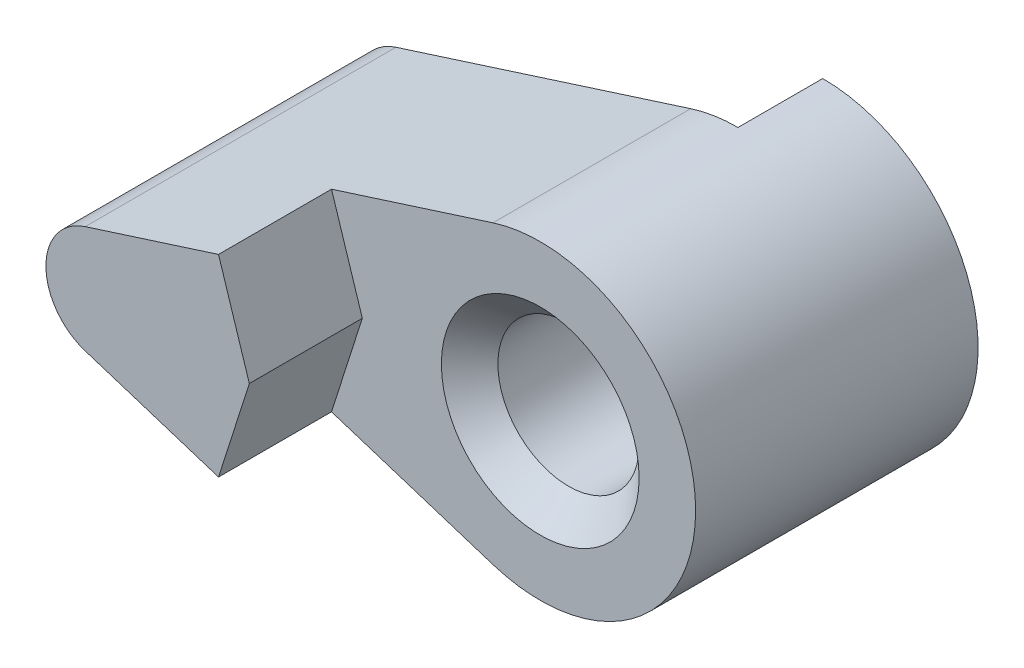
ISO-10303-21;
HEADER;
FILE_DESCRIPTION(('STEP AP214'),'2;1');
FILE_NAME('part.step','',(''),(''),'','','');
FILE_SCHEMA(('AUTOMOTIVE_DESIGN { 1 0 10303 214 1 1 1 1 }'));
ENDSEC;
DATA;
#1=APPLICATION_CONTEXT('core data for automotive mechanical design processes');
#2=APPLICATION_PROTOCOL_DEFINITION('international standard','automotive_design',2000,#1);
#3=PRODUCT_CONTEXT('',#1,'mechanical');
#4=PRODUCT('Part','Part','',(#3));
#5=PRODUCT_RELATED_PRODUCT_CATEGORY('part','',(#4));
#6=PRODUCT_DEFINITION_FORMATION('','',#4);
#7=PRODUCT_DEFINITION_CONTEXT('part definition',#1,'design');
#8=PRODUCT_DEFINITION('design','',#6,#7);
#9=PRODUCT_DEFINITION_SHAPE('','',#8);
#10=(LENGTH_UNIT() NAMED_UNIT(*) SI_UNIT(.MILLI.,.METRE.));
#11=(NAMED_UNIT(*) PLANE_ANGLE_UNIT() SI_UNIT($,.RADIAN.));
#12=(NAMED_UNIT(*) SI_UNIT($,.STERADIAN.) SOLID_ANGLE_UNIT());
#13=UNCERTAINTY_MEASURE_WITH_UNIT(LENGTH_MEASURE(1.E-05),#10,'distance_accuracy_value','');
#14=(GEOMETRIC_REPRESENTATION_CONTEXT(3) GLOBAL_UNCERTAINTY_ASSIGNED_CONTEXT((#13)) GLOBAL_UNIT_ASSIGNED_CONTEXT((#10,
#11,#12)) REPRESENTATION_CONTEXT('',''));
#15=CARTESIAN_POINT('',(0.,0.,0.));
#16=DIRECTION('',(0.,0.,1.));
#17=DIRECTION('',(1.,0.,0.));
#18=AXIS2_PLACEMENT_3D('',#15,#16,#17);
#19=CARTESIAN_POINT('',(-1.67391304347826,5.23908533265811,14.));
#20=DIRECTION('',(0.304347826086956,-0.952560969574202,0.));
#21=DIRECTION('',(0.952560969574202,0.304347826086957,0.));
#22=AXIS2_PLACEMENT_3D('',#19,#20,#21);
#23=PLANE('',#22);
#24=DIRECTION('',(-0.952560969574202,-0.304347826086957,0.));
#25=VECTOR('',#24,1.);
#26=CARTESIAN_POINT('',(-20.9265529123236,-0.912226003494337,3.));
#27=LINE('',#26,#25);
#28=CARTESIAN_POINT('',(-1.67391304347826,5.23908533265811,3.));
#29=VERTEX_POINT('',#28);
#30=CARTESIAN_POINT('',(-12.1086956521739,1.9051219391484,3.));
#31=VERTEX_POINT('',#30);
#32=EDGE_CURVE('E127',#29,#31,#27,.T.);
#33=ORIENTED_EDGE('',*,*,#32,.T.);
#34=DIRECTION('',(0.,0.,-1.));
#35=VECTOR('',#34,1.);
#36=CARTESIAN_POINT('',(-12.1086956521739,1.9051219391484,14.));
#37=LINE('',#36,#35);
#38=CARTESIAN_POINT('',(-12.1086956521739,1.9051219391484,14.));
#39=VERTEX_POINT('',#38);
#40=EDGE_CURVE('E195',#39,#31,#37,.T.);
#41=ORIENTED_EDGE('',*,*,#40,.F.);
#42=DIRECTION('',(-0.952560969574202,-0.304347826086957,0.));
#43=VECTOR('',#42,1.);
#44=CARTESIAN_POINT('',(-1.67391304347826,5.23908533265811,14.));
#45=LINE('',#44,#43);
#46=CARTESIAN_POINT('',(-7.38927886092347,3.41299837613637,14.));
#47=VERTEX_POINT('',#46);
#48=EDGE_CURVE('E181',#47,#39,#45,.T.);
#49=ORIENTED_EDGE('',*,*,#48,.F.);
#50=DIRECTION('',(0.,0.,1.));
#51=VECTOR('',#50,1.);
#52=CARTESIAN_POINT('',(-7.38927886092347,3.41299837613637,10.));
#53=LINE('',#52,#51);
#54=CARTESIAN_POINT('',(-7.38927886092347,3.41299837613637,10.));
#55=VERTEX_POINT('',#54);
#56=EDGE_CURVE('E166',#55,#47,#53,.T.);
#57=ORIENTED_EDGE('',*,*,#56,.F.);
#58=DIRECTION('',(-0.952560969574202,-0.304347826086957,0.));
#59=VECTOR('',#58,1.);
#60=CARTESIAN_POINT('',(-1.67391304347826,5.23908533265811,10.));
#61=LINE('',#60,#59);
#62=CARTESIAN_POINT('',(-1.67391304347826,5.23908533265811,10.));
#63=VERTEX_POINT('',#62);
#64=EDGE_CURVE('E157',#63,#55,#61,.T.);
#65=ORIENTED_EDGE('',*,*,#64,.F.);
#66=DIRECTION('',(0.,0.,-1.));
#67=VECTOR('',#66,1.);
#68=CARTESIAN_POINT('',(-1.67391304347826,5.23908533265811,14.));
#69=LINE('',#68,#67);
#70=EDGE_CURVE('E198',#63,#29,#69,.T.);
#71=ORIENTED_EDGE('',*,*,#70,.T.);
#72=EDGE_LOOP('',(#33,#41,#49,#57,#65,#71));
#73=FACE_BOUND('',#72,.T.);
#74=ADVANCED_FACE('F36',(#73),#23,.F.);
#75=CARTESIAN_POINT('',(-11.5,0.,14.));
#76=DIRECTION('',(0.,0.,-1.));
#77=DIRECTION('',(-1.,0.,0.));
#78=AXIS2_PLACEMENT_3D('',#75,#76,#77);
#79=CYLINDRICAL_SURFACE('',#78,2.);
#80=CARTESIAN_POINT('',(-11.5,0.,3.));
#81=DIRECTION('',(0.,0.,-1.));
#82=DIRECTION('',(-1.,0.,0.));
#83=AXIS2_PLACEMENT_3D('',#80,#81,#82);
#84=CIRCLE('',#83,2.);
#85=CARTESIAN_POINT('',(-12.1086956521739,-1.9051219391484,3.));
#86=VERTEX_POINT('',#85);
#87=EDGE_CURVE('E151',#31,#86,#84,.F.);
#88=ORIENTED_EDGE('',*,*,#87,.T.);
#89=DIRECTION('',(0.,0.,-1.));
#90=VECTOR('',#89,1.);
#91=CARTESIAN_POINT('',(-12.1086956521739,-1.9051219391484,14.));
#92=LINE('',#91,#90);
#93=CARTESIAN_POINT('',(-12.1086956521739,-1.9051219391484,14.));
#94=VERTEX_POINT('',#93);
#95=EDGE_CURVE('E192',#94,#86,#92,.T.);
#96=ORIENTED_EDGE('',*,*,#95,.F.);
#97=CARTESIAN_POINT('',(-11.5,0.,14.));
#98=DIRECTION('',(0.,0.,1.));
#99=DIRECTION('',(1.,0.,0.));
#100=AXIS2_PLACEMENT_3D('',#97,#98,#99);
#101=CIRCLE('',#100,2.);
#102=EDGE_CURVE('E183',#39,#94,#101,.T.);
#103=ORIENTED_EDGE('',*,*,#102,.F.);
#104=ORIENTED_EDGE('',*,*,#40,.T.);
#105=EDGE_LOOP('',(#88,#96,#103,#104));
#106=FACE_BOUND('',#105,.T.);
#107=ADVANCED_FACE('F213',(#106),#79,.T.);
#108=CARTESIAN_POINT('',(-12.1086956521739,-1.9051219391484,14.));
#109=DIRECTION('',(0.304347826086956,0.952560969574202,0.));
#110=DIRECTION('',(-0.952560969574202,0.304347826086956,0.));
#111=AXIS2_PLACEMENT_3D('',#108,#109,#110);
#112=PLANE('',#111);
#113=DIRECTION('',(0.952560969574202,-0.304347826086956,0.));
#114=VECTOR('',#113,1.);
#115=CARTESIAN_POINT('',(-20.9265529123236,0.912226003494337,3.));
#116=LINE('',#115,#114);
#117=CARTESIAN_POINT('',(-1.67391304347826,-5.23908533265811,3.));
#118=VERTEX_POINT('',#117);
#119=EDGE_CURVE('E268',#86,#118,#116,.T.);
#120=ORIENTED_EDGE('',*,*,#119,.T.);
#121=DIRECTION('',(0.,0.,-1.));
#122=VECTOR('',#121,1.);
#123=CARTESIAN_POINT('',(-1.67391304347826,-5.23908533265811,14.));
#124=LINE('',#123,#122);
#125=CARTESIAN_POINT('',(-1.67391304347826,-5.23908533265811,10.));
#126=VERTEX_POINT('',#125);
#127=EDGE_CURVE('E188',#126,#118,#124,.T.);
#128=ORIENTED_EDGE('',*,*,#127,.F.);
#129=DIRECTION('',(0.952560969574202,-0.304347826086957,0.));
#130=VECTOR('',#129,1.);
#131=CARTESIAN_POINT('',(-1.67391304347826,-5.23908533265811,10.));
#132=LINE('',#131,#130);
#133=CARTESIAN_POINT('',(-7.38927886092347,-3.41299837613637,10.));
#134=VERTEX_POINT('',#133);
#135=EDGE_CURVE('E164',#134,#126,#132,.T.);
#136=ORIENTED_EDGE('',*,*,#135,.F.);
#137=DIRECTION('',(0.,0.,1.));
#138=VECTOR('',#137,1.);
#139=CARTESIAN_POINT('',(-7.38927886092347,-3.41299837613637,10.));
#140=LINE('',#139,#138);
#141=CARTESIAN_POINT('',(-7.38927886092347,-3.41299837613637,14.));
#142=VERTEX_POINT('',#141);
#143=EDGE_CURVE('E172',#134,#142,#140,.T.);
#144=ORIENTED_EDGE('',*,*,#143,.T.);
#145=DIRECTION('',(0.952560969574202,-0.304347826086956,0.));
#146=VECTOR('',#145,1.);
#147=CARTESIAN_POINT('',(-12.1086956521739,-1.9051219391484,14.));
#148=LINE('',#147,#146);
#149=EDGE_CURVE('E185',#94,#142,#148,.T.);
#150=ORIENTED_EDGE('',*,*,#149,.F.);
#151=ORIENTED_EDGE('',*,*,#95,.T.);
#152=EDGE_LOOP('',(#120,#128,#136,#144,#150,#151));
#153=FACE_BOUND('',#152,.T.);
#154=ADVANCED_FACE('F219',(#153),#112,.F.);
#155=CARTESIAN_POINT('',(0.,0.,14.));
#156=DIRECTION('',(0.,0.,-1.));
#157=DIRECTION('',(-1.,0.,0.));
#158=AXIS2_PLACEMENT_3D('',#155,#156,#157);
#159=CYLINDRICAL_SURFACE('',#158,5.5);
#160=CARTESIAN_POINT('',(0.,0.,0.));
#161=DIRECTION('',(0.,0.,1.));
#162=DIRECTION('',(1.,0.,0.));
#163=AXIS2_PLACEMENT_3D('',#160,#161,#162);
#164=CIRCLE('',#163,5.5);
#165=CARTESIAN_POINT('',(1.88111078829118,-5.16830941432249,0.));
#166=VERTEX_POINT('',#165);
#167=CARTESIAN_POINT('',(0.,5.5,0.));
#168=VERTEX_POINT('',#167);
#169=EDGE_CURVE('E147',#166,#168,#164,.T.);
#170=ORIENTED_EDGE('',*,*,#169,.T.);
#171=DIRECTION('',(0.,0.,-1.));
#172=VECTOR('',#171,1.);
#173=CARTESIAN_POINT('',(0.,5.5,3.));
#174=LINE('',#173,#172);
#175=CARTESIAN_POINT('',(0.,5.5,3.));
#176=VERTEX_POINT('',#175);
#177=EDGE_CURVE('E136',#176,#168,#174,.T.);
#178=ORIENTED_EDGE('',*,*,#177,.F.);
#179=CARTESIAN_POINT('',(0.,0.,3.));
#180=DIRECTION('',(0.,0.,-1.));
#181=DIRECTION('',(-1.,0.,0.));
#182=AXIS2_PLACEMENT_3D('',#179,#180,#181);
#183=CIRCLE('',#182,5.5);
#184=EDGE_CURVE('E120',#176,#29,#183,.F.);
#185=ORIENTED_EDGE('',*,*,#184,.T.);
#186=ORIENTED_EDGE('',*,*,#70,.F.);
#187=CARTESIAN_POINT('',(0.,0.,10.));
#188=DIRECTION('',(0.,0.,1.));
#189=DIRECTION('',(1.,0.,0.));
#190=AXIS2_PLACEMENT_3D('',#187,#188,#189);
#191=CIRCLE('',#190,5.5);
#192=EDGE_CURVE('E155',#126,#63,#191,.T.);
#193=ORIENTED_EDGE('',*,*,#192,.F.);
#194=ORIENTED_EDGE('',*,*,#127,.T.);
#195=CARTESIAN_POINT('',(1.88111078829118,-5.16830941432249,3.));
#196=VERTEX_POINT('',#195);
#197=EDGE_CURVE('E51',#118,#196,#183,.F.);
#198=ORIENTED_EDGE('',*,*,#197,.T.);
#199=DIRECTION('',(0.,0.,-1.));
#200=VECTOR('',#199,1.);
#201=CARTESIAN_POINT('',(1.88111078829118,-5.16830941432249,3.));
#202=LINE('',#201,#200);
#203=EDGE_CURVE('E170',#196,#166,#202,.T.);
#204=ORIENTED_EDGE('',*,*,#203,.T.);
#205=EDGE_LOOP('',(#170,#178,#185,#186,#193,#194,#198,#204));
#206=FACE_BOUND('',#205,.T.);
#207=ADVANCED_FACE('F144',(#206),#159,.T.);
#208=CARTESIAN_POINT('',(0.,0.,14.));
#209=DIRECTION('',(0.,0.,-1.));
#210=DIRECTION('',(-1.,0.,0.));
#211=AXIS2_PLACEMENT_3D('',#208,#209,#210);
#212=CYLINDRICAL_SURFACE('',#211,2.5);
#213=CARTESIAN_POINT('',(0.,0.,9.));
#214=DIRECTION('',(0.,0.,1.));
#215=DIRECTION('',(1.,0.,0.));
#216=AXIS2_PLACEMENT_3D('',#213,#214,#215);
#217=CIRCLE('',#216,2.5);
#218=CARTESIAN_POINT('',(2.5,0.,9.));
#219=VERTEX_POINT('',#218);
#220=EDGE_CURVE('E44',#219,#219,#217,.T.);
#221=ORIENTED_EDGE('',*,*,#220,.T.);
#222=EDGE_LOOP('',(#221));
#223=FACE_BOUND('',#222,.T.);
#224=DIRECTION('',(0.,0.,-1.));
#225=VECTOR('',#224,1.);
#226=CARTESIAN_POINT('',(1.34174848841226,-2.10943380883199,3.));
#227=LINE('',#226,#225);
#228=CARTESIAN_POINT('',(1.34174848841226,-2.10943380883199,3.));
#229=VERTEX_POINT('',#228);
#230=CARTESIAN_POINT('',(1.34174848841226,-2.10943380883199,0.));
#231=VERTEX_POINT('',#230);
#232=EDGE_CURVE('E149',#229,#231,#227,.T.);
#233=ORIENTED_EDGE('',*,*,#232,.F.);
#234=CARTESIAN_POINT('',(0.,0.,3.));
#235=DIRECTION('',(0.,0.,-1.));
#236=DIRECTION('',(-1.,0.,0.));
#237=AXIS2_PLACEMENT_3D('',#234,#235,#236);
#238=CIRCLE('',#237,2.5);
#239=CARTESIAN_POINT('',(0.539362299878918,2.44112439450949,3.));
#240=VERTEX_POINT('',#239);
#241=EDGE_CURVE('E140',#240,#229,#238,.F.);
#242=ORIENTED_EDGE('',*,*,#241,.F.);
#243=DIRECTION('',(0.,0.,-1.));
#244=VECTOR('',#243,1.);
#245=CARTESIAN_POINT('',(0.539362299878918,2.44112439450949,3.));
#246=LINE('',#245,#244);
#247=CARTESIAN_POINT('',(0.539362299878918,2.44112439450949,0.));
#248=VERTEX_POINT('',#247);
#249=EDGE_CURVE('E139',#240,#248,#246,.T.);
#250=ORIENTED_EDGE('',*,*,#249,.T.);
#251=CARTESIAN_POINT('',(0.,0.,0.));
#252=DIRECTION('',(0.,0.,1.));
#253=DIRECTION('',(1.,0.,0.));
#254=AXIS2_PLACEMENT_3D('',#251,#252,#253);
#255=CIRCLE('',#254,2.5);
#256=EDGE_CURVE('E175',#231,#248,#255,.T.);
#257=ORIENTED_EDGE('',*,*,#256,.F.);
#258=EDGE_LOOP('',(#233,#242,#250,#257));
#259=FACE_BOUND('',#258,.T.);
#260=ADVANCED_FACE('F202',(#223,#259),#212,.F.);
#261=CARTESIAN_POINT('',(0.,0.,14.));
#262=DIRECTION('',(0.,0.,1.));
#263=DIRECTION('',(1.,0.,0.));
#264=AXIS2_PLACEMENT_3D('',#261,#262,#263);
#265=PLANE('',#264);
#266=DIRECTION('',(-0.304347826086957,-0.952560969574202,0.));
#267=VECTOR('',#266,1.);
#268=CARTESIAN_POINT('',(-6.29880941130941,0.,14.));
#269=LINE('',#268,#267);
#270=CARTESIAN_POINT('',(-6.29880941130941,0.,14.));
#271=VERTEX_POINT('',#270);
#272=EDGE_CURVE('E158',#271,#142,#269,.T.);
#273=ORIENTED_EDGE('',*,*,#272,.F.);
#274=DIRECTION('',(0.304347826086957,-0.952560969574202,0.));
#275=VECTOR('',#274,1.);
#276=CARTESIAN_POINT('',(-7.38927886092347,3.41299837613637,14.));
#277=LINE('',#276,#275);
#278=EDGE_CURVE('E167',#47,#271,#277,.T.);
#279=ORIENTED_EDGE('',*,*,#278,.F.);
#280=ORIENTED_EDGE('',*,*,#48,.T.);
#281=ORIENTED_EDGE('',*,*,#102,.T.);
#282=ORIENTED_EDGE('',*,*,#149,.T.);
#283=EDGE_LOOP('',(#273,#279,#280,#281,#282));
#284=FACE_BOUND('',#283,.T.);
#285=ADVANCED_FACE('F228',(#284),#265,.T.);
#286=CARTESIAN_POINT('',(0.,0.,0.));
#287=DIRECTION('',(0.,0.,1.));
#288=DIRECTION('',(1.,0.,0.));
#289=AXIS2_PLACEMENT_3D('',#286,#287,#288);
#290=PLANE('',#289);
#291=ORIENTED_EDGE('',*,*,#169,.F.);
#292=DIRECTION('',(0.173648177666931,-0.984807753012208,0.));
#293=VECTOR('',#292,1.);
#294=CARTESIAN_POINT('',(0.300754000321379,3.79433930580006,0.));
#295=LINE('',#294,#293);
#296=EDGE_CURVE('E132',#231,#166,#295,.T.);
#297=ORIENTED_EDGE('',*,*,#296,.F.);
#298=ORIENTED_EDGE('',*,*,#256,.T.);
#299=EDGE_CURVE('E262',#168,#248,#295,.T.);
#300=ORIENTED_EDGE('',*,*,#299,.F.);
#301=EDGE_LOOP('',(#291,#297,#298,#300));
#302=FACE_BOUND('',#301,.T.);
#303=ADVANCED_FACE('F234',(#302),#290,.F.);
#304=CARTESIAN_POINT('',(-6.29880941130941,0.,10.));
#305=DIRECTION('',(-0.952560969574202,0.304347826086957,0.));
#306=DIRECTION('',(-0.304347826086957,-0.952560969574202,0.));
#307=AXIS2_PLACEMENT_3D('',#304,#305,#306);
#308=PLANE('',#307);
#309=ORIENTED_EDGE('',*,*,#272,.T.);
#310=ORIENTED_EDGE('',*,*,#143,.F.);
#311=DIRECTION('',(-0.304347826086957,-0.952560969574202,0.));
#312=VECTOR('',#311,1.);
#313=CARTESIAN_POINT('',(-6.29880941130941,0.,10.));
#314=LINE('',#313,#312);
#315=CARTESIAN_POINT('',(-6.29880941130941,0.,10.));
#316=VERTEX_POINT('',#315);
#317=EDGE_CURVE('E59',#316,#134,#314,.T.);
#318=ORIENTED_EDGE('',*,*,#317,.F.);
#319=DIRECTION('',(0.,0.,1.));
#320=VECTOR('',#319,1.);
#321=CARTESIAN_POINT('',(-6.29880941130941,0.,10.));
#322=LINE('',#321,#320);
#323=EDGE_CURVE('E176',#316,#271,#322,.T.);
#324=ORIENTED_EDGE('',*,*,#323,.T.);
#325=EDGE_LOOP('',(#309,#310,#318,#324));
#326=FACE_BOUND('',#325,.T.);
#327=ADVANCED_FACE('F237',(#326),#308,.F.);
#328=CARTESIAN_POINT('',(-7.38927886092347,3.41299837613637,10.));
#329=DIRECTION('',(-0.952560969574202,-0.304347826086957,0.));
#330=DIRECTION('',(0.304347826086957,-0.952560969574202,0.));
#331=AXIS2_PLACEMENT_3D('',#328,#329,#330);
#332=PLANE('',#331);
#333=ORIENTED_EDGE('',*,*,#278,.T.);
#334=ORIENTED_EDGE('',*,*,#323,.F.);
#335=DIRECTION('',(0.304347826086957,-0.952560969574202,0.));
#336=VECTOR('',#335,1.);
#337=CARTESIAN_POINT('',(-7.38927886092347,3.41299837613637,10.));
#338=LINE('',#337,#336);
#339=EDGE_CURVE('E161',#55,#316,#338,.T.);
#340=ORIENTED_EDGE('',*,*,#339,.F.);
#341=ORIENTED_EDGE('',*,*,#56,.T.);
#342=EDGE_LOOP('',(#333,#334,#340,#341));
#343=FACE_BOUND('',#342,.T.);
#344=ADVANCED_FACE('F242',(#343),#332,.F.);
#345=CARTESIAN_POINT('',(0.,0.,10.));
#346=DIRECTION('',(0.,0.,1.));
#347=DIRECTION('',(1.,0.,0.));
#348=AXIS2_PLACEMENT_3D('',#345,#346,#347);
#349=PLANE('',#348);
#350=CARTESIAN_POINT('',(0.,0.,10.));
#351=DIRECTION('',(0.,0.,1.));
#352=DIRECTION('',(1.,0.,0.));
#353=AXIS2_PLACEMENT_3D('',#350,#351,#352);
#354=CIRCLE('',#353,3.50000000000001);
#355=CARTESIAN_POINT('',(3.50000000000001,0.,10.));
#356=VERTEX_POINT('',#355);
#357=EDGE_CURVE('E11',#356,#356,#354,.F.);
#358=ORIENTED_EDGE('',*,*,#357,.T.);
#359=EDGE_LOOP('',(#358));
#360=FACE_BOUND('',#359,.T.);
#361=ORIENTED_EDGE('',*,*,#192,.T.);
#362=ORIENTED_EDGE('',*,*,#64,.T.);
#363=ORIENTED_EDGE('',*,*,#339,.T.);
#364=ORIENTED_EDGE('',*,*,#317,.T.);
#365=ORIENTED_EDGE('',*,*,#135,.T.);
#366=EDGE_LOOP('',(#361,#362,#363,#364,#365));
#367=FACE_BOUND('',#366,.T.);
#368=ADVANCED_FACE('F245',(#360,#367),#349,.T.);
#369=CARTESIAN_POINT('',(0.300754000321379,3.79433930580006,3.));
#370=DIRECTION('',(0.984807753012208,0.173648177666931,0.));
#371=DIRECTION('',(-0.173648177666931,0.984807753012208,0.));
#372=AXIS2_PLACEMENT_3D('',#369,#370,#371);
#373=PLANE('',#372);
#374=ORIENTED_EDGE('',*,*,#296,.T.);
#375=ORIENTED_EDGE('',*,*,#203,.F.);
#376=DIRECTION('',(0.173648177666931,-0.984807753012208,0.));
#377=VECTOR('',#376,1.);
#378=CARTESIAN_POINT('',(0.300754000321379,3.79433930580006,3.));
#379=LINE('',#378,#377);
#380=EDGE_CURVE('E142',#229,#196,#379,.T.);
#381=ORIENTED_EDGE('',*,*,#380,.F.);
#382=ORIENTED_EDGE('',*,*,#232,.T.);
#383=EDGE_LOOP('',(#374,#375,#381,#382));
#384=FACE_BOUND('',#383,.T.);
#385=ADVANCED_FACE('F252',(#384),#373,.F.);
#386=ORIENTED_EDGE('',*,*,#299,.T.);
#387=ORIENTED_EDGE('',*,*,#249,.F.);
#388=EDGE_CURVE('E124',#176,#240,#379,.T.);
#389=ORIENTED_EDGE('',*,*,#388,.F.);
#390=ORIENTED_EDGE('',*,*,#177,.T.);
#391=EDGE_LOOP('',(#386,#387,#389,#390));
#392=FACE_BOUND('',#391,.T.);
#393=ADVANCED_FACE('F135',(#392),#373,.F.);
#394=CARTESIAN_POINT('',(-21.2180135221233,0.,3.));
#395=DIRECTION('',(0.,0.,-1.));
#396=DIRECTION('',(-1.,0.,0.));
#397=AXIS2_PLACEMENT_3D('',#394,#395,#396);
#398=PLANE('',#397);
#399=ORIENTED_EDGE('',*,*,#184,.F.);
#400=ORIENTED_EDGE('',*,*,#388,.T.);
#401=ORIENTED_EDGE('',*,*,#241,.T.);
#402=ORIENTED_EDGE('',*,*,#380,.T.);
#403=ORIENTED_EDGE('',*,*,#197,.F.);
#404=ORIENTED_EDGE('',*,*,#119,.F.);
#405=ORIENTED_EDGE('',*,*,#87,.F.);
#406=ORIENTED_EDGE('',*,*,#32,.F.);
#407=EDGE_LOOP('',(#399,#400,#401,#402,#403,#404,#405,#406));
#408=FACE_BOUND('',#407,.T.);
#409=ADVANCED_FACE('F122',(#408),#398,.T.);
#410=CARTESIAN_POINT('',(0.,0.,9.));
#411=DIRECTION('',(0.,0.,1.));
#412=DIRECTION('',(1.,0.,0.));
#413=AXIS2_PLACEMENT_3D('',#410,#411,#412);
#414=CONICAL_SURFACE('',#413,2.5,0.785398163397451);
#415=ORIENTED_EDGE('',*,*,#357,.F.);
#416=EDGE_LOOP('',(#415));
#417=FACE_BOUND('',#416,.T.);
#418=ORIENTED_EDGE('',*,*,#220,.F.);
#419=EDGE_LOOP('',(#418));
#420=FACE_BOUND('',#419,.T.);
#421=ADVANCED_FACE('F38',(#417,#420),#414,.F.);
#422=CLOSED_SHELL('',(#74,#107,#154,#207,#260,#285,#303,#327,#344,#368,#385,#393,#409,#421));
#423=MANIFOLD_SOLID_BREP('B2',#422);
#424=ADVANCED_BREP_SHAPE_REPRESENTATION('',(#18,#423),#14);
#425=SHAPE_DEFINITION_REPRESENTATION(#9,#424);
ENDSEC;
END-ISO-10303-21;
